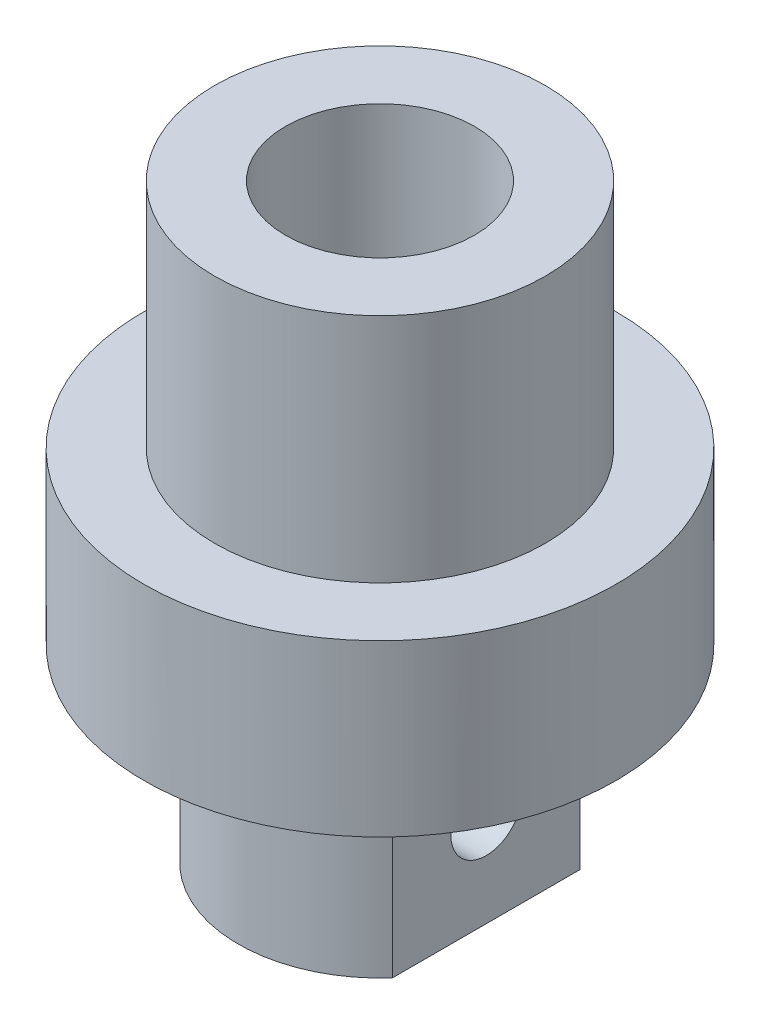
ISO-10303-21;
HEADER;
FILE_DESCRIPTION(('STEP AP214'),'2;1');
FILE_NAME('part.step','',(''),(''),'','','');
FILE_SCHEMA(('AUTOMOTIVE_DESIGN { 1 0 10303 214 1 1 1 1 }'));
ENDSEC;
DATA;
#1=APPLICATION_CONTEXT('core data for automotive mechanical design processes');
#2=APPLICATION_PROTOCOL_DEFINITION('international standard','automotive_design',2000,#1);
#3=PRODUCT_CONTEXT('',#1,'mechanical');
#4=PRODUCT('Part','Part','',(#3));
#5=PRODUCT_RELATED_PRODUCT_CATEGORY('part','',(#4));
#6=PRODUCT_DEFINITION_FORMATION('','',#4);
#7=PRODUCT_DEFINITION_CONTEXT('part definition',#1,'design');
#8=PRODUCT_DEFINITION('design','',#6,#7);
#9=PRODUCT_DEFINITION_SHAPE('','',#8);
#10=(LENGTH_UNIT() NAMED_UNIT(*) SI_UNIT(.MILLI.,.METRE.));
#11=(NAMED_UNIT(*) PLANE_ANGLE_UNIT() SI_UNIT($,.RADIAN.));
#12=(NAMED_UNIT(*) SI_UNIT($,.STERADIAN.) SOLID_ANGLE_UNIT());
#13=UNCERTAINTY_MEASURE_WITH_UNIT(LENGTH_MEASURE(1.E-05),#10,'distance_accuracy_value','');
#14=(GEOMETRIC_REPRESENTATION_CONTEXT(3) GLOBAL_UNCERTAINTY_ASSIGNED_CONTEXT((#13)) GLOBAL_UNIT_ASSIGNED_CONTEXT((#10,
#11,#12)) REPRESENTATION_CONTEXT('',''));
#15=CARTESIAN_POINT('',(0.,0.,0.));
#16=DIRECTION('',(0.,0.,1.));
#17=DIRECTION('',(1.,0.,0.));
#18=AXIS2_PLACEMENT_3D('',#15,#16,#17);
#19=CARTESIAN_POINT('',(0.,25.,0.));
#20=DIRECTION('',(0.,-1.,0.));
#21=DIRECTION('',(0.,0.,-1.));
#22=AXIS2_PLACEMENT_3D('',#19,#20,#21);
#23=CYLINDRICAL_SURFACE('',#22,10.);
#24=CARTESIAN_POINT('',(0.,15.2,0.));
#25=DIRECTION('',(0.,1.,0.));
#26=DIRECTION('',(0.,0.,1.));
#27=AXIS2_PLACEMENT_3D('',#24,#25,#26);
#28=CIRCLE('',#27,10.);
#29=CARTESIAN_POINT('',(0.,15.2,10.));
#30=VERTEX_POINT('',#29);
#31=EDGE_CURVE('E11',#30,#30,#28,.T.);
#32=ORIENTED_EDGE('',*,*,#31,.F.);
#33=EDGE_LOOP('',(#32));
#34=FACE_BOUND('',#33,.T.);
#35=CARTESIAN_POINT('',(0.,8.,0.));
#36=DIRECTION('',(0.,-1.,0.));
#37=DIRECTION('',(0.,0.,-1.));
#38=AXIS2_PLACEMENT_3D('',#35,#36,#37);
#39=CIRCLE('',#38,10.);
#40=CARTESIAN_POINT('',(0.,8.,-10.));
#41=VERTEX_POINT('',#40);
#42=EDGE_CURVE('E79',#41,#41,#39,.T.);
#43=ORIENTED_EDGE('',*,*,#42,.F.);
#44=EDGE_LOOP('',(#43));
#45=FACE_BOUND('',#44,.T.);
#46=ADVANCED_FACE('F35',(#34,#45),#23,.T.);
#47=CARTESIAN_POINT('',(0.,15.2,0.));
#48=DIRECTION('',(0.,1.,0.));
#49=DIRECTION('',(0.,0.,1.));
#50=AXIS2_PLACEMENT_3D('',#47,#48,#49);
#51=PLANE('',#50);
#52=CARTESIAN_POINT('',(0.,15.2,0.));
#53=DIRECTION('',(0.,1.,0.));
#54=DIRECTION('',(0.,0.,1.));
#55=AXIS2_PLACEMENT_3D('',#52,#53,#54);
#56=CIRCLE('',#55,7.);
#57=CARTESIAN_POINT('',(0.,15.2,7.));
#58=VERTEX_POINT('',#57);
#59=EDGE_CURVE('E43',#58,#58,#56,.T.);
#60=ORIENTED_EDGE('',*,*,#59,.F.);
#61=EDGE_LOOP('',(#60));
#62=FACE_BOUND('',#61,.T.);
#63=ORIENTED_EDGE('',*,*,#31,.T.);
#64=EDGE_LOOP('',(#63));
#65=FACE_BOUND('',#64,.T.);
#66=ADVANCED_FACE('F98',(#62,#65),#51,.T.);
#67=CARTESIAN_POINT('',(0.,15.2,0.));
#68=DIRECTION('',(0.,1.,0.));
#69=DIRECTION('',(0.,0.,1.));
#70=AXIS2_PLACEMENT_3D('',#67,#68,#69);
#71=CYLINDRICAL_SURFACE('',#70,7.);
#72=ORIENTED_EDGE('',*,*,#59,.T.);
#73=EDGE_LOOP('',(#72));
#74=FACE_BOUND('',#73,.T.);
#75=CARTESIAN_POINT('',(0.,25.,0.));
#76=DIRECTION('',(0.,1.,0.));
#77=DIRECTION('',(0.,0.,1.));
#78=AXIS2_PLACEMENT_3D('',#75,#76,#77);
#79=CIRCLE('',#78,7.);
#80=CARTESIAN_POINT('',(0.,25.,7.));
#81=VERTEX_POINT('',#80);
#82=EDGE_CURVE('E88',#81,#81,#79,.T.);
#83=ORIENTED_EDGE('',*,*,#82,.F.);
#84=EDGE_LOOP('',(#83));
#85=FACE_BOUND('',#84,.T.);
#86=ADVANCED_FACE('F96',(#74,#85),#71,.T.);
#87=CARTESIAN_POINT('',(0.,25.,0.));
#88=DIRECTION('',(0.,1.,0.));
#89=DIRECTION('',(0.,0.,1.));
#90=AXIS2_PLACEMENT_3D('',#87,#88,#89);
#91=PLANE('',#90);
#92=CARTESIAN_POINT('',(0.,25.,0.));
#93=DIRECTION('',(0.,1.,0.));
#94=DIRECTION('',(0.,0.,1.));
#95=AXIS2_PLACEMENT_3D('',#92,#93,#94);
#96=CIRCLE('',#95,4.);
#97=CARTESIAN_POINT('',(0.,25.,4.));
#98=VERTEX_POINT('',#97);
#99=EDGE_CURVE('E82',#98,#98,#96,.T.);
#100=ORIENTED_EDGE('',*,*,#99,.F.);
#101=EDGE_LOOP('',(#100));
#102=FACE_BOUND('',#101,.T.);
#103=ORIENTED_EDGE('',*,*,#82,.T.);
#104=EDGE_LOOP('',(#103));
#105=FACE_BOUND('',#104,.T.);
#106=ADVANCED_FACE('F94',(#102,#105),#91,.T.);
#107=CARTESIAN_POINT('',(0.,8.,0.));
#108=DIRECTION('',(0.,-1.,0.));
#109=DIRECTION('',(0.,0.,-1.));
#110=AXIS2_PLACEMENT_3D('',#107,#108,#109);
#111=PLANE('',#110);
#112=CARTESIAN_POINT('',(0.,8.,0.));
#113=DIRECTION('',(0.,-1.,0.));
#114=DIRECTION('',(0.,0.,-1.));
#115=AXIS2_PLACEMENT_3D('',#112,#113,#114);
#116=CIRCLE('',#115,6.);
#117=CARTESIAN_POINT('',(4.5,8.,3.96862696659689));
#118=VERTEX_POINT('',#117);
#119=CARTESIAN_POINT('',(4.5,8.,-3.96862696659689));
#120=VERTEX_POINT('',#119);
#121=EDGE_CURVE('E74',#118,#120,#116,.T.);
#122=ORIENTED_EDGE('',*,*,#121,.F.);
#123=DIRECTION('',(0.,0.,1.));
#124=VECTOR('',#123,1.);
#125=CARTESIAN_POINT('',(4.5,8.,0.));
#126=LINE('',#125,#124);
#127=EDGE_CURVE('E56',#120,#118,#126,.T.);
#128=ORIENTED_EDGE('',*,*,#127,.F.);
#129=EDGE_LOOP('',(#122,#128));
#130=FACE_BOUND('',#129,.T.);
#131=ORIENTED_EDGE('',*,*,#42,.T.);
#132=EDGE_LOOP('',(#131));
#133=FACE_BOUND('',#132,.T.);
#134=ADVANCED_FACE('F105',(#130,#133),#111,.T.);
#135=CARTESIAN_POINT('',(0.,8.,0.));
#136=DIRECTION('',(0.,-1.,0.));
#137=DIRECTION('',(0.,0.,-1.));
#138=AXIS2_PLACEMENT_3D('',#135,#136,#137);
#139=CYLINDRICAL_SURFACE('',#138,6.);
#140=DIRECTION('',(0.,-1.,0.));
#141=VECTOR('',#140,1.);
#142=CARTESIAN_POINT('',(4.5,16.0777472107018,-3.96862696659689));
#143=LINE('',#142,#141);
#144=CARTESIAN_POINT('',(4.5,0.,-3.96862696659689));
#145=VERTEX_POINT('',#144);
#146=EDGE_CURVE('E64',#120,#145,#143,.T.);
#147=ORIENTED_EDGE('',*,*,#146,.T.);
#148=CARTESIAN_POINT('',(0.,0.,0.));
#149=DIRECTION('',(0.,-1.,0.));
#150=DIRECTION('',(0.,0.,-1.));
#151=AXIS2_PLACEMENT_3D('',#148,#149,#150);
#152=CIRCLE('',#151,6.);
#153=CARTESIAN_POINT('',(4.5,0.,3.96862696659689));
#154=VERTEX_POINT('',#153);
#155=EDGE_CURVE('E73',#154,#145,#152,.T.);
#156=ORIENTED_EDGE('',*,*,#155,.F.);
#157=DIRECTION('',(0.,-1.,0.));
#158=VECTOR('',#157,1.);
#159=CARTESIAN_POINT('',(4.5,16.0777472107018,3.96862696659689));
#160=LINE('',#159,#158);
#161=EDGE_CURVE('E50',#118,#154,#160,.T.);
#162=ORIENTED_EDGE('',*,*,#161,.F.);
#163=ORIENTED_EDGE('',*,*,#121,.T.);
#164=EDGE_LOOP('',(#147,#156,#162,#163));
#165=FACE_BOUND('',#164,.T.);
#166=ADVANCED_FACE('F72',(#165),#139,.T.);
#167=CARTESIAN_POINT('',(0.,0.,0.));
#168=DIRECTION('',(0.,1.,0.));
#169=DIRECTION('',(0.,0.,1.));
#170=AXIS2_PLACEMENT_3D('',#167,#168,#169);
#171=PLANE('',#170);
#172=CARTESIAN_POINT('',(0.,0.,0.));
#173=DIRECTION('',(0.,-1.,0.));
#174=DIRECTION('',(0.,0.,-1.));
#175=AXIS2_PLACEMENT_3D('',#172,#173,#174);
#176=CIRCLE('',#175,2.75);
#177=CARTESIAN_POINT('',(0.,0.,-2.75));
#178=VERTEX_POINT('',#177);
#179=EDGE_CURVE('E165',#178,#178,#176,.T.);
#180=ORIENTED_EDGE('',*,*,#179,.F.);
#181=EDGE_LOOP('',(#180));
#182=FACE_BOUND('',#181,.T.);
#183=ORIENTED_EDGE('',*,*,#155,.T.);
#184=DIRECTION('',(0.,0.,-1.));
#185=VECTOR('',#184,1.);
#186=CARTESIAN_POINT('',(4.5,0.,0.));
#187=LINE('',#186,#185);
#188=EDGE_CURVE('E61',#154,#145,#187,.T.);
#189=ORIENTED_EDGE('',*,*,#188,.F.);
#190=EDGE_LOOP('',(#183,#189));
#191=FACE_BOUND('',#190,.T.);
#192=ADVANCED_FACE('F76',(#182,#191),#171,.F.);
#193=CARTESIAN_POINT('',(0.,10.,0.));
#194=DIRECTION('',(0.,1.,0.));
#195=DIRECTION('',(0.,0.,1.));
#196=AXIS2_PLACEMENT_3D('',#193,#194,#195);
#197=CYLINDRICAL_SURFACE('',#196,4.);
#198=CARTESIAN_POINT('',(0.,10.,0.));
#199=DIRECTION('',(0.,1.,0.));
#200=DIRECTION('',(0.,0.,1.));
#201=AXIS2_PLACEMENT_3D('',#198,#199,#200);
#202=CIRCLE('',#201,4.);
#203=CARTESIAN_POINT('',(0.,10.,4.));
#204=VERTEX_POINT('',#203);
#205=EDGE_CURVE('E77',#204,#204,#202,.T.);
#206=ORIENTED_EDGE('',*,*,#205,.F.);
#207=EDGE_LOOP('',(#206));
#208=FACE_BOUND('',#207,.T.);
#209=ORIENTED_EDGE('',*,*,#99,.T.);
#210=EDGE_LOOP('',(#209));
#211=FACE_BOUND('',#210,.T.);
#212=ADVANCED_FACE('F125',(#208,#211),#197,.F.);
#213=CARTESIAN_POINT('',(0.,10.,0.));
#214=DIRECTION('',(0.,1.,0.));
#215=DIRECTION('',(0.,0.,1.));
#216=AXIS2_PLACEMENT_3D('',#213,#214,#215);
#217=PLANE('',#216);
#218=CARTESIAN_POINT('',(0.,10.,0.));
#219=DIRECTION('',(0.,1.,0.));
#220=DIRECTION('',(0.,0.,1.));
#221=AXIS2_PLACEMENT_3D('',#218,#219,#220);
#222=CIRCLE('',#221,2.75);
#223=CARTESIAN_POINT('',(0.,10.,2.75));
#224=VERTEX_POINT('',#223);
#225=EDGE_CURVE('E38',#224,#224,#222,.T.);
#226=ORIENTED_EDGE('',*,*,#225,.F.);
#227=EDGE_LOOP('',(#226));
#228=FACE_BOUND('',#227,.T.);
#229=ORIENTED_EDGE('',*,*,#205,.T.);
#230=EDGE_LOOP('',(#229));
#231=FACE_BOUND('',#230,.T.);
#232=ADVANCED_FACE('F128',(#228,#231),#217,.T.);
#233=CARTESIAN_POINT('',(0.,11.,0.));
#234=DIRECTION('',(0.,-1.,0.));
#235=DIRECTION('',(0.,0.,-1.));
#236=AXIS2_PLACEMENT_3D('',#233,#234,#235);
#237=CYLINDRICAL_SURFACE('',#236,2.75);
#238=CARTESIAN_POINT('',(2.30488611432322,4.,-1.5));
#239=CARTESIAN_POINT('',(2.30489421024473,4.07699779806487,-1.49999413135082));
#240=CARTESIAN_POINT('',(2.30880529285267,4.15406589028088,-1.49403027924783));
#241=CARTESIAN_POINT('',(2.32384224007238,4.30574199009364,-1.47052310835782));
#242=CARTESIAN_POINT('',(2.33498052302754,4.38034553059235,-1.45295985764456));
#243=CARTESIAN_POINT('',(2.3627764835554,4.52459697964569,-1.40729873671328));
#244=CARTESIAN_POINT('',(2.37940017833793,4.59427227001694,-1.37926559118574));
#245=CARTESIAN_POINT('',(2.41623891176822,4.72790558740957,-1.31365953143235));
#246=CARTESIAN_POINT('',(2.43645465582752,4.79186248773054,-1.27608474278248));
#247=CARTESIAN_POINT('',(2.48063952354997,4.91923299542113,-1.18809985416578));
#248=CARTESIAN_POINT('',(2.50478202629872,4.98196229322643,-1.13678582957949));
#249=CARTESIAN_POINT('',(2.55270819572039,5.09847211904161,-1.0246471812684));
#250=CARTESIAN_POINT('',(2.57649164378584,5.15224738062038,-0.963817000999298));
#251=CARTESIAN_POINT('',(2.62340283071844,5.25376924114969,-0.828145519509227));
#252=CARTESIAN_POINT('',(2.6463074970794,5.30062942127502,-0.752556357772132));
#253=CARTESIAN_POINT('',(2.68653962553174,5.38064983098284,-0.593081630877459));
#254=CARTESIAN_POINT('',(2.70387126555191,5.41382032861845,-0.509202342542044));
#255=CARTESIAN_POINT('',(2.72973873797664,5.46265687107757,-0.342815290452241));
#256=CARTESIAN_POINT('',(2.73887971624644,5.47953610911523,-0.260759956132087));
#257=CARTESIAN_POINT('',(2.74963355912743,5.49935260419856,-0.0945174753778729));
#258=CARTESIAN_POINT('',(2.75125201680447,5.50230021956618,-0.0103319595955279));
#259=CARTESIAN_POINT('',(2.74701957382299,5.49453009710724,0.14846327320301));
#260=CARTESIAN_POINT('',(2.74192108417944,5.48518905368924,0.223165914968654));
#261=CARTESIAN_POINT('',(2.72602671127768,5.45563618654128,0.369747996654061));
#262=CARTESIAN_POINT('',(2.71523039181036,5.43542353051036,0.441627219968471));
#263=CARTESIAN_POINT('',(2.6887521363836,5.38468767085777,0.581590054068015));
#264=CARTESIAN_POINT('',(2.6730172005102,5.35405229874575,0.649622561481079));
#265=CARTESIAN_POINT('',(2.6380078811625,5.28355787286259,0.779717351324896));
#266=CARTESIAN_POINT('',(2.61873234990232,5.24369582690635,0.841777687733638));
#267=CARTESIAN_POINT('',(2.57594789072271,5.15103183541585,0.965247684465645));
#268=CARTESIAN_POINT('',(2.55220670898869,5.09730302043104,1.0258813450631));
#269=CARTESIAN_POINT('',(2.5043506209711,4.98086252286927,1.13773322094231));
#270=CARTESIAN_POINT('',(2.48023536122881,4.91814181653975,1.18894185846822));
#271=CARTESIAN_POINT('',(2.43203284519694,4.77903442998941,1.28484880406853));
#272=CARTESIAN_POINT('',(2.40812394765973,4.70193804311146,1.32861732314198));
#273=CARTESIAN_POINT('',(2.36600204452007,4.53994724146604,1.40226549882536));
#274=CARTESIAN_POINT('',(2.34778248453195,4.45506194691092,1.43216115707827));
#275=CARTESIAN_POINT('',(2.3213279168276,4.28699193820886,1.47462584067532));
#276=CARTESIAN_POINT('',(2.31240382292294,4.20422619701024,1.48840195774998));
#277=CARTESIAN_POINT('',(2.30368170332884,4.03711516410618,1.50187468275518));
#278=CARTESIAN_POINT('',(2.30387370470172,3.95277169942795,1.50158667671771));
#279=CARTESIAN_POINT('',(2.3126305306804,3.79775047652571,1.48804477103612));
#280=CARTESIAN_POINT('',(2.3200042154775,3.72683085105699,1.47663524601722));
#281=CARTESIAN_POINT('',(2.34039421161149,3.58810455316619,1.4440986516865));
#282=CARTESIAN_POINT('',(2.35341292151871,3.52029921756451,1.42296745140319));
#283=CARTESIAN_POINT('',(2.38424525155975,3.38635116386947,1.37070327109686));
#284=CARTESIAN_POINT('',(2.40224030430737,3.32040393333961,1.3391807933206));
#285=CARTESIAN_POINT('',(2.44089767814822,3.1943400205406,1.26735224561409));
#286=CARTESIAN_POINT('',(2.46156132917246,3.13422627180312,1.22704178914011));
#287=CARTESIAN_POINT('',(2.50707449046941,3.01174835733169,1.13149902493738));
#288=CARTESIAN_POINT('',(2.53207564414213,2.9504849185977,1.07492150821778));
#289=CARTESIAN_POINT('',(2.58077925000358,2.83789007675645,0.952074999249045));
#290=CARTESIAN_POINT('',(2.60448096812037,2.78656424695229,0.885800605073047));
#291=CARTESIAN_POINT('',(2.64932207741289,2.69302898716975,0.741333475405946));
#292=CARTESIAN_POINT('',(2.67028379015716,2.65137562546324,0.662721266201903));
#293=CARTESIAN_POINT('',(2.70581165423852,2.58232681010377,0.498139546402609));
#294=CARTESIAN_POINT('',(2.72038436754133,2.55491672218883,0.412177693411001));
#295=CARTESIAN_POINT('',(2.74025647456966,2.51786585131271,0.244694259646485));
#296=CARTESIAN_POINT('',(2.74634426689626,2.50670911002371,0.16360202677511));
#297=CARTESIAN_POINT('',(2.75120766093104,2.49778138478019,0.000479702749198982));
#298=CARTESIAN_POINT('',(2.74998697472649,2.50000360545084,-0.0815498911768442));
#299=CARTESIAN_POINT('',(2.7408062740845,2.51690874560204,-0.236627195915184));
#300=CARTESIAN_POINT('',(2.73344230866801,2.53048986226603,-0.309835076654748));
#301=CARTESIAN_POINT('',(2.71343280563989,2.56805386360794,-0.452760156657307));
#302=CARTESIAN_POINT('',(2.70078662768826,2.59203800941406,-0.522476931560607));
#303=CARTESIAN_POINT('',(2.67075918156193,2.65051659849986,-0.65925983097359));
#304=CARTESIAN_POINT('',(2.65322685931173,2.68535139711625,-0.72614617629664));
#305=CARTESIAN_POINT('',(2.61509254701012,2.7641213309472,-0.853350781635772));
#306=CARTESIAN_POINT('',(2.59448929214413,2.80806021875481,-0.913666317553959));
#307=CARTESIAN_POINT('',(2.54937874301812,2.90952811770235,-1.03329759578331));
#308=CARTESIAN_POINT('',(2.52469397477493,2.96803458596534,-1.09171873998499));
#309=CARTESIAN_POINT('',(2.47586448118113,3.09403227114023,-1.19835006802307));
#310=CARTESIAN_POINT('',(2.45172042730756,3.16153400645246,-1.24654812408245));
#311=CARTESIAN_POINT('',(2.40519083827524,3.30888912321508,-1.33423124165438));
#312=CARTESIAN_POINT('',(2.38301155100028,3.38925244979211,-1.37297721552888));
#313=CARTESIAN_POINT('',(2.34568463982656,3.55691256585195,-1.43583608451424));
#314=CARTESIAN_POINT('',(2.3305144527591,3.64418603278147,-1.45999601205782));
#315=CARTESIAN_POINT('',(2.31521887971068,3.77717145061058,-1.48402805225692));
#316=CARTESIAN_POINT('',(2.3113659920565,3.82142792819731,-1.49000328847283));
#317=CARTESIAN_POINT('',(2.30619725664355,3.91044834310442,-1.49799096623255));
#318=CARTESIAN_POINT('',(2.30488140512533,3.95521227967273,-1.50000341364851));
#319=CARTESIAN_POINT('',(2.30488611432322,4.,-1.5));
#320=B_SPLINE_CURVE_WITH_KNOTS('',3,(#238,#239,#240,#241,#242,#243,#244,#245,#246,#247,#248,
#249,#250,#251,#252,#253,#254,#255,#256,#257,#258,#259,#260,#261,#262,#263,#264,#265,#266,#267,
#268,#269,#270,#271,#272,#273,#274,#275,#276,#277,#278,#279,#280,#281,#282,#283,#284,#285,#286,
#287,#288,#289,#290,#291,#292,#293,#294,#295,#296,#297,#298,#299,#300,#301,#302,#303,#304,#305,
#306,#307,#308,#309,#310,#311,#312,#313,#314,#315,#316,#317,#318,#319),.UNSPECIFIED.,.T.,.F.,(4,
2,2,2,2,2,2,2,2,2,2,2,2,2,2,2,2,2,2,2,2,2,2,2,2,2,2,2,2,2,2,2,2,2,2,2,2,2,2,2,4),(0.,
0.23080347099766,0.462004580637982,0.691799450761133,0.921639498290496,1.17429770256349,
1.42710399005606,1.70115561989817,1.97500131995359,2.22637200026069,2.47755575413936,
2.70285922756718,2.92817995206935,3.15600657629094,3.38390718783626,3.63612516342407,
3.88859804585918,4.16263764047266,4.43636035373905,4.68791635355979,4.93919715941133,
5.1548459636411,5.37058648694268,5.59556414270453,5.82065435485592,6.08070639443118,
6.34090385904457,6.6135949958041,6.88600539910123,7.1308830001167,7.37563623463374,
7.5990787534829,7.82254836717645,8.05388690243173,8.28532098294443,8.54308768651386,
8.80115849247891,9.07546804719126,9.34888830494877,9.48314119122965,9.6173938785714),.UNSPECIFIED.);
#321=CARTESIAN_POINT('',(2.30488611432322,4.,-1.5));
#322=VERTEX_POINT('',#321);
#323=EDGE_CURVE('E69',#322,#322,#320,.T.);
#324=ORIENTED_EDGE('',*,*,#323,.T.);
#325=EDGE_LOOP('',(#324));
#326=FACE_BOUND('',#325,.T.);
#327=ORIENTED_EDGE('',*,*,#225,.T.);
#328=EDGE_LOOP('',(#327));
#329=FACE_BOUND('',#328,.T.);
#330=ORIENTED_EDGE('',*,*,#179,.T.);
#331=EDGE_LOOP('',(#330));
#332=FACE_BOUND('',#331,.T.);
#333=ADVANCED_FACE('F132',(#326,#329,#332),#237,.F.);
#334=CARTESIAN_POINT('',(4.5,16.0777472107018,0.));
#335=DIRECTION('',(-1.,0.,0.));
#336=DIRECTION('',(0.,0.,1.));
#337=AXIS2_PLACEMENT_3D('',#334,#335,#336);
#338=PLANE('',#337);
#339=CARTESIAN_POINT('',(4.5,4.,0.));
#340=DIRECTION('',(1.,0.,0.));
#341=DIRECTION('',(0.,0.,-1.));
#342=AXIS2_PLACEMENT_3D('',#339,#340,#341);
#343=CIRCLE('',#342,1.5);
#344=CARTESIAN_POINT('',(4.5,4.,-1.5));
#345=VERTEX_POINT('',#344);
#346=EDGE_CURVE('E146',#345,#345,#343,.T.);
#347=ORIENTED_EDGE('',*,*,#346,.F.);
#348=EDGE_LOOP('',(#347));
#349=FACE_BOUND('',#348,.T.);
#350=ORIENTED_EDGE('',*,*,#127,.T.);
#351=ORIENTED_EDGE('',*,*,#161,.T.);
#352=ORIENTED_EDGE('',*,*,#188,.T.);
#353=ORIENTED_EDGE('',*,*,#146,.F.);
#354=EDGE_LOOP('',(#350,#351,#352,#353));
#355=FACE_BOUND('',#354,.T.);
#356=ADVANCED_FACE('F63',(#349,#355),#338,.F.);
#357=CARTESIAN_POINT('',(0.500000000000004,4.,0.));
#358=DIRECTION('',(1.,0.,0.));
#359=DIRECTION('',(0.,0.,-1.));
#360=AXIS2_PLACEMENT_3D('',#357,#358,#359);
#361=CYLINDRICAL_SURFACE('',#360,1.5);
#362=ORIENTED_EDGE('',*,*,#346,.T.);
#363=EDGE_LOOP('',(#362));
#364=FACE_BOUND('',#363,.T.);
#365=ORIENTED_EDGE('',*,*,#323,.F.);
#366=EDGE_LOOP('',(#365));
#367=FACE_BOUND('',#366,.T.);
#368=ADVANCED_FACE('F147',(#364,#367),#361,.F.);
#369=CLOSED_SHELL('',(#46,#66,#86,#106,#134,#166,#192,#212,#232,#333,#356,#368));
#370=MANIFOLD_SOLID_BREP('B2',#369);
#371=ADVANCED_BREP_SHAPE_REPRESENTATION('',(#18,#370),#14);
#372=SHAPE_DEFINITION_REPRESENTATION(#9,#371);
ENDSEC;
END-ISO-10303-21;
